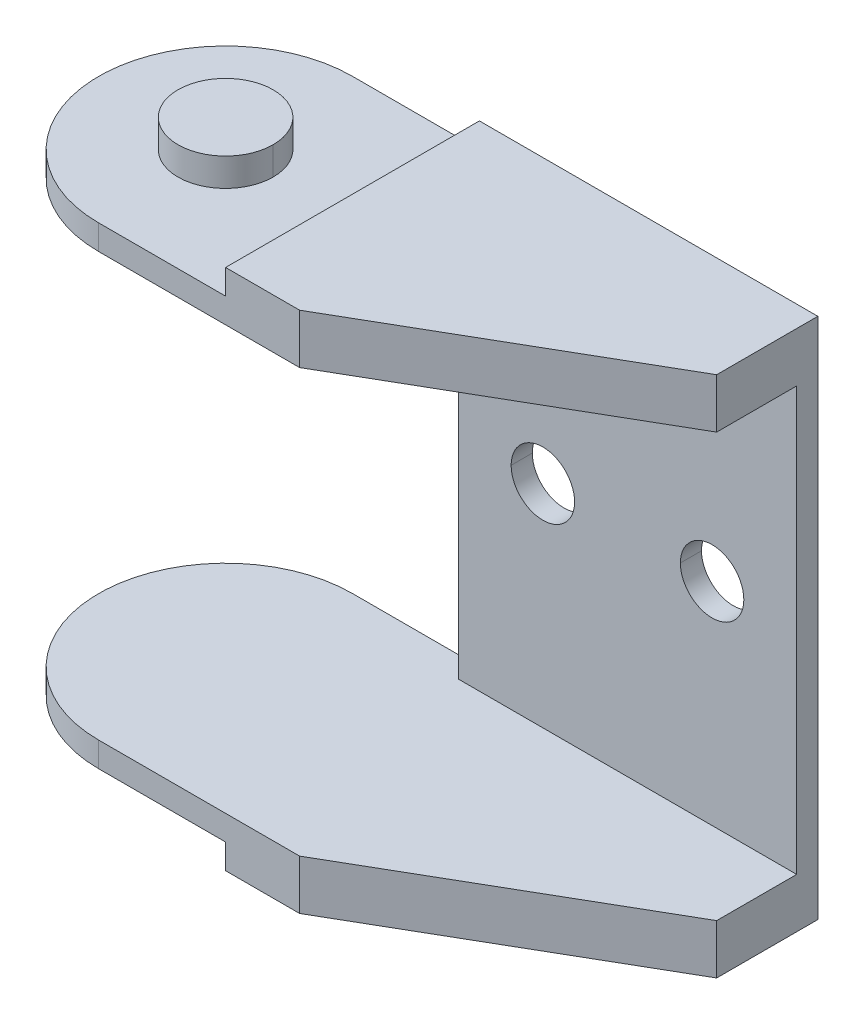
ISO-10303-21;
HEADER;
FILE_DESCRIPTION(('STEP AP214'),'2;1');
FILE_NAME('part.step','',(''),(''),'','','');
FILE_SCHEMA(('AUTOMOTIVE_DESIGN { 1 0 10303 214 1 1 1 1 }'));
ENDSEC;
DATA;
#1=APPLICATION_CONTEXT('core data for automotive mechanical design processes');
#2=APPLICATION_PROTOCOL_DEFINITION('international standard','automotive_design',2000,#1);
#3=PRODUCT_CONTEXT('',#1,'mechanical');
#4=PRODUCT('Part','Part','',(#3));
#5=PRODUCT_RELATED_PRODUCT_CATEGORY('part','',(#4));
#6=PRODUCT_DEFINITION_FORMATION('','',#4);
#7=PRODUCT_DEFINITION_CONTEXT('part definition',#1,'design');
#8=PRODUCT_DEFINITION('design','',#6,#7);
#9=PRODUCT_DEFINITION_SHAPE('','',#8);
#10=(LENGTH_UNIT() NAMED_UNIT(*) SI_UNIT(.MILLI.,.METRE.));
#11=(NAMED_UNIT(*) PLANE_ANGLE_UNIT() SI_UNIT($,.RADIAN.));
#12=(NAMED_UNIT(*) SI_UNIT($,.STERADIAN.) SOLID_ANGLE_UNIT());
#13=UNCERTAINTY_MEASURE_WITH_UNIT(LENGTH_MEASURE(1.E-05),#10,'distance_accuracy_value','');
#14=(GEOMETRIC_REPRESENTATION_CONTEXT(3) GLOBAL_UNCERTAINTY_ASSIGNED_CONTEXT((#13)) GLOBAL_UNIT_ASSIGNED_CONTEXT((#10,
#11,#12)) REPRESENTATION_CONTEXT('',''));
#15=CARTESIAN_POINT('',(0.,0.,0.));
#16=DIRECTION('',(0.,0.,1.));
#17=DIRECTION('',(1.,0.,0.));
#18=AXIS2_PLACEMENT_3D('',#15,#16,#17);
#19=CARTESIAN_POINT('',(22.,-2.35,-3.60843918245));
#20=DIRECTION('',(1.,0.,0.));
#21=DIRECTION('',(0.,1.,0.));
#22=AXIS2_PLACEMENT_3D('',#19,#20,#21);
#23=PLANE('',#22);
#24=DIRECTION('',(0.,1.,0.));
#25=VECTOR('',#24,1.);
#26=CARTESIAN_POINT('',(22.,-2.35,-6.));
#27=LINE('',#26,#25);
#28=CARTESIAN_POINT('',(22.,-2.35,-6.));
#29=VERTEX_POINT('',#28);
#30=CARTESIAN_POINT('',(22.,22.35,-6.));
#31=VERTEX_POINT('',#30);
#32=EDGE_CURVE('E340',#29,#31,#27,.T.);
#33=ORIENTED_EDGE('',*,*,#32,.T.);
#34=DIRECTION('',(0.,0.,1.));
#35=VECTOR('',#34,1.);
#36=CARTESIAN_POINT('',(22.,22.35,-1.2168783649));
#37=LINE('',#36,#35);
#38=CARTESIAN_POINT('',(22.,22.35,-1.2168783649));
#39=VERTEX_POINT('',#38);
#40=EDGE_CURVE('E365',#31,#39,#37,.T.);
#41=ORIENTED_EDGE('',*,*,#40,.T.);
#42=DIRECTION('',(0.,1.,0.));
#43=VECTOR('',#42,1.);
#44=CARTESIAN_POINT('',(22.,-2.35,-1.2168783649));
#45=LINE('',#44,#43);
#46=CARTESIAN_POINT('',(22.,20.,-1.2168783649));
#47=VERTEX_POINT('',#46);
#48=EDGE_CURVE('E288',#47,#39,#45,.T.);
#49=ORIENTED_EDGE('',*,*,#48,.F.);
#50=DIRECTION('',(0.,0.,-1.));
#51=VECTOR('',#50,1.);
#52=CARTESIAN_POINT('',(22.,20.,-1.804219591225));
#53=LINE('',#52,#51);
#54=CARTESIAN_POINT('',(22.,20.,-5.));
#55=VERTEX_POINT('',#54);
#56=EDGE_CURVE('E350',#47,#55,#53,.T.);
#57=ORIENTED_EDGE('',*,*,#56,.T.);
#58=DIRECTION('',(0.,1.,0.));
#59=VECTOR('',#58,1.);
#60=CARTESIAN_POINT('',(22.,-1.175,-5.));
#61=LINE('',#60,#59);
#62=CARTESIAN_POINT('',(22.,0.,-5.));
#63=VERTEX_POINT('',#62);
#64=EDGE_CURVE('E274',#63,#55,#61,.T.);
#65=ORIENTED_EDGE('',*,*,#64,.F.);
#66=DIRECTION('',(0.,0.,1.));
#67=VECTOR('',#66,1.);
#68=CARTESIAN_POINT('',(22.,0.,-1.804219591225));
#69=LINE('',#68,#67);
#70=CARTESIAN_POINT('',(22.,0.,-1.2168783649));
#71=VERTEX_POINT('',#70);
#72=EDGE_CURVE('E11',#63,#71,#69,.T.);
#73=ORIENTED_EDGE('',*,*,#72,.T.);
#74=DIRECTION('',(0.,1.,0.));
#75=VECTOR('',#74,1.);
#76=CARTESIAN_POINT('',(22.,-2.35,-1.2168783649));
#77=LINE('',#76,#75);
#78=CARTESIAN_POINT('',(22.,-2.35,-1.2168783649));
#79=VERTEX_POINT('',#78);
#80=EDGE_CURVE('E348',#79,#71,#77,.T.);
#81=ORIENTED_EDGE('',*,*,#80,.F.);
#82=DIRECTION('',(0.,0.,-1.));
#83=VECTOR('',#82,1.);
#84=CARTESIAN_POINT('',(22.,-2.35,-1.2168783649));
#85=LINE('',#84,#83);
#86=EDGE_CURVE('E282',#79,#29,#85,.T.);
#87=ORIENTED_EDGE('',*,*,#86,.T.);
#88=EDGE_LOOP('',(#33,#41,#49,#57,#65,#73,#81,#87));
#89=FACE_BOUND('',#88,.T.);
#90=ADVANCED_FACE('F16',(#89),#23,.T.);
#91=CARTESIAN_POINT('',(0.,-2.35,0.));
#92=DIRECTION('',(0.,1.,0.));
#93=DIRECTION('',(0.,0.,1.));
#94=AXIS2_PLACEMENT_3D('',#91,#92,#93);
#95=CYLINDRICAL_SURFACE('',#94,6.);
#96=CARTESIAN_POINT('',(0.,-1.175,0.));
#97=DIRECTION('',(0.,1.,0.));
#98=DIRECTION('',(0.,0.,1.));
#99=AXIS2_PLACEMENT_3D('',#96,#97,#98);
#100=CIRCLE('',#99,6.);
#101=CARTESIAN_POINT('',(0.,-1.175,-6.));
#102=VERTEX_POINT('',#101);
#103=CARTESIAN_POINT('',(0.,-1.175,6.));
#104=VERTEX_POINT('',#103);
#105=EDGE_CURVE('E293',#102,#104,#100,.T.);
#106=ORIENTED_EDGE('',*,*,#105,.T.);
#107=DIRECTION('',(0.,1.,0.));
#108=VECTOR('',#107,1.);
#109=CARTESIAN_POINT('',(0.,-2.35,6.));
#110=LINE('',#109,#108);
#111=CARTESIAN_POINT('',(0.,0.,6.));
#112=VERTEX_POINT('',#111);
#113=EDGE_CURVE('E393',#104,#112,#110,.T.);
#114=ORIENTED_EDGE('',*,*,#113,.T.);
#115=CARTESIAN_POINT('',(0.,0.,0.));
#116=DIRECTION('',(0.,-1.,0.));
#117=DIRECTION('',(0.,0.,1.));
#118=AXIS2_PLACEMENT_3D('',#115,#116,#117);
#119=CIRCLE('',#118,6.);
#120=CARTESIAN_POINT('',(0.,0.,-6.));
#121=VERTEX_POINT('',#120);
#122=EDGE_CURVE('E25',#112,#121,#119,.T.);
#123=ORIENTED_EDGE('',*,*,#122,.T.);
#124=DIRECTION('',(0.,1.,0.));
#125=VECTOR('',#124,1.);
#126=CARTESIAN_POINT('',(0.,-2.35,-6.));
#127=LINE('',#126,#125);
#128=EDGE_CURVE('E341',#102,#121,#127,.T.);
#129=ORIENTED_EDGE('',*,*,#128,.F.);
#130=EDGE_LOOP('',(#106,#114,#123,#129));
#131=FACE_BOUND('',#130,.T.);
#132=ADVANCED_FACE('F544',(#131),#95,.T.);
#133=CARTESIAN_POINT('',(0.,0.,0.));
#134=DIRECTION('',(0.,-1.,0.));
#135=DIRECTION('',(0.,0.,-1.));
#136=AXIS2_PLACEMENT_3D('',#133,#134,#135);
#137=PLANE('',#136);
#138=DIRECTION('',(0.,0.,-1.));
#139=VECTOR('',#138,1.);
#140=CARTESIAN_POINT('',(6.,0.,-2.75));
#141=LINE('',#140,#139);
#142=CARTESIAN_POINT('',(6.,0.,-5.));
#143=VERTEX_POINT('',#142);
#144=CARTESIAN_POINT('',(6.,0.,-6.));
#145=VERTEX_POINT('',#144);
#146=EDGE_CURVE('E399',#143,#145,#141,.T.);
#147=ORIENTED_EDGE('',*,*,#146,.T.);
#148=DIRECTION('',(1.,0.,0.));
#149=VECTOR('',#148,1.);
#150=CARTESIAN_POINT('',(5.5,0.,-6.));
#151=LINE('',#150,#149);
#152=EDGE_CURVE('E337',#121,#145,#151,.T.);
#153=ORIENTED_EDGE('',*,*,#152,.F.);
#154=ORIENTED_EDGE('',*,*,#122,.F.);
#155=DIRECTION('',(-1.,0.,0.));
#156=VECTOR('',#155,1.);
#157=CARTESIAN_POINT('',(2.375,0.,6.));
#158=LINE('',#157,#156);
#159=CARTESIAN_POINT('',(9.5,0.,6.));
#160=VERTEX_POINT('',#159);
#161=EDGE_CURVE('E47',#160,#112,#158,.T.);
#162=ORIENTED_EDGE('',*,*,#161,.F.);
#163=DIRECTION('',(-0.866025403783548,0.,0.500000000001542));
#164=VECTOR('',#163,1.);
#165=CARTESIAN_POINT('',(14.4865381056782,0.,3.12102088235054));
#166=LINE('',#165,#164);
#167=EDGE_CURVE('E349',#71,#160,#166,.T.);
#168=ORIENTED_EDGE('',*,*,#167,.F.);
#169=ORIENTED_EDGE('',*,*,#72,.F.);
#170=DIRECTION('',(-1.,0.,0.));
#171=VECTOR('',#170,1.);
#172=CARTESIAN_POINT('',(7.,0.,-5.));
#173=LINE('',#172,#171);
#174=EDGE_CURVE('E332',#63,#143,#173,.T.);
#175=ORIENTED_EDGE('',*,*,#174,.T.);
#176=EDGE_LOOP('',(#147,#153,#154,#162,#168,#169,#175));
#177=FACE_BOUND('',#176,.T.);
#178=ADVANCED_FACE('F540',(#177),#137,.F.);
#179=CARTESIAN_POINT('',(4.75,-2.35,6.));
#180=DIRECTION('',(0.,0.,1.));
#181=DIRECTION('',(1.,0.,0.));
#182=AXIS2_PLACEMENT_3D('',#179,#180,#181);
#183=PLANE('',#182);
#184=DIRECTION('',(0.,-1.,0.));
#185=VECTOR('',#184,1.);
#186=CARTESIAN_POINT('',(6.,-2.05625,6.));
#187=LINE('',#186,#185);
#188=CARTESIAN_POINT('',(6.,-1.175,6.));
#189=VERTEX_POINT('',#188);
#190=CARTESIAN_POINT('',(6.,-2.35,6.));
#191=VERTEX_POINT('',#190);
#192=EDGE_CURVE('E207',#189,#191,#187,.T.);
#193=ORIENTED_EDGE('',*,*,#192,.T.);
#194=DIRECTION('',(1.,0.,0.));
#195=VECTOR('',#194,1.);
#196=CARTESIAN_POINT('',(0.,-2.35,6.));
#197=LINE('',#196,#195);
#198=CARTESIAN_POINT('',(9.5,-2.35,6.));
#199=VERTEX_POINT('',#198);
#200=EDGE_CURVE('E219',#191,#199,#197,.T.);
#201=ORIENTED_EDGE('',*,*,#200,.T.);
#202=DIRECTION('',(0.,1.,0.));
#203=VECTOR('',#202,1.);
#204=CARTESIAN_POINT('',(9.5,-2.35,6.));
#205=LINE('',#204,#203);
#206=EDGE_CURVE('E346',#199,#160,#205,.T.);
#207=ORIENTED_EDGE('',*,*,#206,.T.);
#208=ORIENTED_EDGE('',*,*,#161,.T.);
#209=ORIENTED_EDGE('',*,*,#113,.F.);
#210=DIRECTION('',(1.,0.,0.));
#211=VECTOR('',#210,1.);
#212=CARTESIAN_POINT('',(-2.125,-1.175,6.));
#213=LINE('',#212,#211);
#214=EDGE_CURVE('E277',#104,#189,#213,.T.);
#215=ORIENTED_EDGE('',*,*,#214,.T.);
#216=EDGE_LOOP('',(#193,#201,#207,#208,#209,#215));
#217=FACE_BOUND('',#216,.T.);
#218=ADVANCED_FACE('F543',(#217),#183,.T.);
#219=CARTESIAN_POINT('',(15.75,-2.35,2.39156081755));
#220=DIRECTION('',(0.500000000001542,0.,0.866025403783548));
#221=DIRECTION('',(0.,-1.,0.));
#222=AXIS2_PLACEMENT_3D('',#219,#220,#221);
#223=PLANE('',#222);
#224=ORIENTED_EDGE('',*,*,#167,.T.);
#225=ORIENTED_EDGE('',*,*,#206,.F.);
#226=DIRECTION('',(0.866025403783548,0.,-0.500000000001542));
#227=VECTOR('',#226,1.);
#228=CARTESIAN_POINT('',(9.5,-2.35,6.));
#229=LINE('',#228,#227);
#230=EDGE_CURVE('E286',#199,#79,#229,.T.);
#231=ORIENTED_EDGE('',*,*,#230,.T.);
#232=ORIENTED_EDGE('',*,*,#80,.T.);
#233=EDGE_LOOP('',(#224,#225,#231,#232));
#234=FACE_BOUND('',#233,.T.);
#235=ADVANCED_FACE('F538',(#234),#223,.T.);
#236=CARTESIAN_POINT('',(11.,-2.35,-6.));
#237=DIRECTION('',(0.,0.,-1.));
#238=DIRECTION('',(0.,-1.,0.));
#239=AXIS2_PLACEMENT_3D('',#236,#237,#238);
#240=PLANE('',#239);
#241=CARTESIAN_POINT('',(18.,10.,-6.));
#242=DIRECTION('',(0.,0.,1.));
#243=DIRECTION('',(1.,0.,0.));
#244=AXIS2_PLACEMENT_3D('',#241,#242,#243);
#245=CIRCLE('',#244,1.5);
#246=CARTESIAN_POINT('',(19.5,10.,-6.));
#247=VERTEX_POINT('',#246);
#248=CARTESIAN_POINT('',(16.5,10.,-6.));
#249=VERTEX_POINT('',#248);
#250=EDGE_CURVE('E322',#247,#249,#245,.T.);
#251=ORIENTED_EDGE('',*,*,#250,.T.);
#252=CARTESIAN_POINT('',(18.,10.,-6.));
#253=DIRECTION('',(0.,0.,1.));
#254=DIRECTION('',(1.,0.,0.));
#255=AXIS2_PLACEMENT_3D('',#252,#253,#254);
#256=CIRCLE('',#255,1.5);
#257=EDGE_CURVE('E307',#249,#247,#256,.T.);
#258=ORIENTED_EDGE('',*,*,#257,.T.);
#259=EDGE_LOOP('',(#251,#258));
#260=FACE_BOUND('',#259,.T.);
#261=CARTESIAN_POINT('',(10.,10.,-6.));
#262=DIRECTION('',(0.,0.,1.));
#263=DIRECTION('',(1.,0.,0.));
#264=AXIS2_PLACEMENT_3D('',#261,#262,#263);
#265=CIRCLE('',#264,1.5);
#266=CARTESIAN_POINT('',(11.5,10.,-6.));
#267=VERTEX_POINT('',#266);
#268=CARTESIAN_POINT('',(8.5,10.,-6.));
#269=VERTEX_POINT('',#268);
#270=EDGE_CURVE('E313',#267,#269,#265,.T.);
#271=ORIENTED_EDGE('',*,*,#270,.T.);
#272=CARTESIAN_POINT('',(10.,10.,-6.));
#273=DIRECTION('',(0.,0.,1.));
#274=DIRECTION('',(1.,0.,0.));
#275=AXIS2_PLACEMENT_3D('',#272,#273,#274);
#276=CIRCLE('',#275,1.5);
#277=EDGE_CURVE('E308',#269,#267,#276,.T.);
#278=ORIENTED_EDGE('',*,*,#277,.T.);
#279=EDGE_LOOP('',(#271,#278));
#280=FACE_BOUND('',#279,.T.);
#281=DIRECTION('',(0.,1.,0.));
#282=VECTOR('',#281,1.);
#283=CARTESIAN_POINT('',(6.,-2.05625,-6.));
#284=LINE('',#283,#282);
#285=CARTESIAN_POINT('',(6.,-2.35,-6.));
#286=VERTEX_POINT('',#285);
#287=CARTESIAN_POINT('',(6.,-1.175,-6.));
#288=VERTEX_POINT('',#287);
#289=EDGE_CURVE('E385',#286,#288,#284,.T.);
#290=ORIENTED_EDGE('',*,*,#289,.T.);
#291=DIRECTION('',(-1.,0.,0.));
#292=VECTOR('',#291,1.);
#293=CARTESIAN_POINT('',(1.,-1.175,-6.));
#294=LINE('',#293,#292);
#295=EDGE_CURVE('E296',#288,#102,#294,.T.);
#296=ORIENTED_EDGE('',*,*,#295,.T.);
#297=ORIENTED_EDGE('',*,*,#128,.T.);
#298=ORIENTED_EDGE('',*,*,#152,.T.);
#299=DIRECTION('',(0.,1.,0.));
#300=VECTOR('',#299,1.);
#301=CARTESIAN_POINT('',(6.,-1.175,-6.));
#302=LINE('',#301,#300);
#303=CARTESIAN_POINT('',(6.,20.,-6.));
#304=VERTEX_POINT('',#303);
#305=EDGE_CURVE('E273',#145,#304,#302,.T.);
#306=ORIENTED_EDGE('',*,*,#305,.T.);
#307=DIRECTION('',(-1.,0.,0.));
#308=VECTOR('',#307,1.);
#309=CARTESIAN_POINT('',(5.5,20.,-6.));
#310=LINE('',#309,#308);
#311=CARTESIAN_POINT('',(0.,20.,-6.));
#312=VERTEX_POINT('',#311);
#313=EDGE_CURVE('E465',#304,#312,#310,.T.);
#314=ORIENTED_EDGE('',*,*,#313,.T.);
#315=DIRECTION('',(0.,1.,0.));
#316=VECTOR('',#315,1.);
#317=CARTESIAN_POINT('',(0.,-2.35,-6.));
#318=LINE('',#317,#316);
#319=CARTESIAN_POINT('',(0.,21.175,-6.));
#320=VERTEX_POINT('',#319);
#321=EDGE_CURVE('E345',#312,#320,#318,.T.);
#322=ORIENTED_EDGE('',*,*,#321,.T.);
#323=DIRECTION('',(1.,0.,0.));
#324=VECTOR('',#323,1.);
#325=CARTESIAN_POINT('',(1.,21.175,-6.));
#326=LINE('',#325,#324);
#327=CARTESIAN_POINT('',(6.,21.175,-6.));
#328=VERTEX_POINT('',#327);
#329=EDGE_CURVE('E247',#320,#328,#326,.T.);
#330=ORIENTED_EDGE('',*,*,#329,.T.);
#331=DIRECTION('',(0.,1.,0.));
#332=VECTOR('',#331,1.);
#333=CARTESIAN_POINT('',(6.,9.70625,-6.));
#334=LINE('',#333,#332);
#335=CARTESIAN_POINT('',(6.,22.35,-6.));
#336=VERTEX_POINT('',#335);
#337=EDGE_CURVE('E253',#328,#336,#334,.T.);
#338=ORIENTED_EDGE('',*,*,#337,.T.);
#339=DIRECTION('',(1.,0.,0.));
#340=VECTOR('',#339,1.);
#341=CARTESIAN_POINT('',(22.,22.35,-6.));
#342=LINE('',#341,#340);
#343=EDGE_CURVE('E353',#336,#31,#342,.T.);
#344=ORIENTED_EDGE('',*,*,#343,.T.);
#345=ORIENTED_EDGE('',*,*,#32,.F.);
#346=DIRECTION('',(-1.,0.,0.));
#347=VECTOR('',#346,1.);
#348=CARTESIAN_POINT('',(22.,-2.35,-6.));
#349=LINE('',#348,#347);
#350=EDGE_CURVE('E287',#29,#286,#349,.T.);
#351=ORIENTED_EDGE('',*,*,#350,.T.);
#352=EDGE_LOOP('',(#290,#296,#297,#298,#306,#314,#322,#330,#338,#344,#345,#351));
#353=FACE_BOUND('',#352,.T.);
#354=ADVANCED_FACE('F593',(#260,#280,#353),#240,.T.);
#355=CARTESIAN_POINT('',(7.97467966244913,-2.35,-0.830003680221399));
#356=DIRECTION('',(0.,-1.,0.));
#357=DIRECTION('',(0.,0.,-1.));
#358=AXIS2_PLACEMENT_3D('',#355,#356,#357);
#359=PLANE('',#358);
#360=DIRECTION('',(0.,0.,-1.));
#361=VECTOR('',#360,1.);
#362=CARTESIAN_POINT('',(6.,-2.35,-0.415001840110699));
#363=LINE('',#362,#361);
#364=EDGE_CURVE('E280',#191,#286,#363,.T.);
#365=ORIENTED_EDGE('',*,*,#364,.T.);
#366=ORIENTED_EDGE('',*,*,#350,.F.);
#367=ORIENTED_EDGE('',*,*,#86,.F.);
#368=ORIENTED_EDGE('',*,*,#230,.F.);
#369=ORIENTED_EDGE('',*,*,#200,.F.);
#370=EDGE_LOOP('',(#365,#366,#367,#368,#369));
#371=FACE_BOUND('',#370,.T.);
#372=ADVANCED_FACE('F603',(#371),#359,.T.);
#373=CARTESIAN_POINT('',(6.,-1.7625,0.));
#374=DIRECTION('',(-1.,0.,0.));
#375=DIRECTION('',(0.,0.,1.));
#376=AXIS2_PLACEMENT_3D('',#373,#374,#375);
#377=PLANE('',#376);
#378=ORIENTED_EDGE('',*,*,#364,.F.);
#379=ORIENTED_EDGE('',*,*,#192,.F.);
#380=DIRECTION('',(0.,0.,-1.));
#381=VECTOR('',#380,1.);
#382=CARTESIAN_POINT('',(6.,-1.175,0.));
#383=LINE('',#382,#381);
#384=EDGE_CURVE('E281',#189,#288,#383,.T.);
#385=ORIENTED_EDGE('',*,*,#384,.T.);
#386=ORIENTED_EDGE('',*,*,#289,.F.);
#387=EDGE_LOOP('',(#378,#379,#385,#386));
#388=FACE_BOUND('',#387,.T.);
#389=ADVANCED_FACE('F614',(#388),#377,.T.);
#390=CARTESIAN_POINT('',(-9.,-1.175,0.));
#391=DIRECTION('',(0.,-1.,0.));
#392=DIRECTION('',(0.,0.,-1.));
#393=AXIS2_PLACEMENT_3D('',#390,#391,#392);
#394=PLANE('',#393);
#395=CARTESIAN_POINT('',(0.,-1.175,0.));
#396=DIRECTION('',(0.,1.,0.));
#397=DIRECTION('',(1.,0.,0.));
#398=AXIS2_PLACEMENT_3D('',#395,#396,#397);
#399=CIRCLE('',#398,2.25);
#400=CARTESIAN_POINT('',(2.25,-1.175,0.));
#401=VERTEX_POINT('',#400);
#402=CARTESIAN_POINT('',(-2.25,-1.175,0.));
#403=VERTEX_POINT('',#402);
#404=EDGE_CURVE('E297',#401,#403,#399,.T.);
#405=ORIENTED_EDGE('',*,*,#404,.T.);
#406=CARTESIAN_POINT('',(0.,-1.175,0.));
#407=DIRECTION('',(0.,1.,0.));
#408=DIRECTION('',(1.,0.,0.));
#409=AXIS2_PLACEMENT_3D('',#406,#407,#408);
#410=CIRCLE('',#409,2.25);
#411=EDGE_CURVE('E303',#403,#401,#410,.T.);
#412=ORIENTED_EDGE('',*,*,#411,.T.);
#413=EDGE_LOOP('',(#405,#412));
#414=FACE_BOUND('',#413,.T.);
#415=ORIENTED_EDGE('',*,*,#105,.F.);
#416=ORIENTED_EDGE('',*,*,#295,.F.);
#417=ORIENTED_EDGE('',*,*,#384,.F.);
#418=ORIENTED_EDGE('',*,*,#214,.F.);
#419=EDGE_LOOP('',(#415,#416,#417,#418));
#420=FACE_BOUND('',#419,.T.);
#421=ADVANCED_FACE('F624',(#414,#420),#394,.T.);
#422=CARTESIAN_POINT('',(0.,-2.5,0.));
#423=DIRECTION('',(0.,-1.,0.));
#424=DIRECTION('',(0.,0.,-1.));
#425=AXIS2_PLACEMENT_3D('',#422,#423,#424);
#426=PLANE('',#425);
#427=CARTESIAN_POINT('',(0.,-2.5,0.));
#428=DIRECTION('',(0.,-1.,0.));
#429=DIRECTION('',(1.,0.,0.));
#430=AXIS2_PLACEMENT_3D('',#427,#428,#429);
#431=CIRCLE('',#430,2.25);
#432=CARTESIAN_POINT('',(2.25,-2.5,0.));
#433=VERTEX_POINT('',#432);
#434=CARTESIAN_POINT('',(-2.25,-2.5,0.));
#435=VERTEX_POINT('',#434);
#436=EDGE_CURVE('E441',#433,#435,#431,.T.);
#437=ORIENTED_EDGE('',*,*,#436,.T.);
#438=CARTESIAN_POINT('',(0.,-2.5,0.));
#439=DIRECTION('',(0.,-1.,0.));
#440=DIRECTION('',(1.,0.,0.));
#441=AXIS2_PLACEMENT_3D('',#438,#439,#440);
#442=CIRCLE('',#441,2.25);
#443=EDGE_CURVE('E291',#435,#433,#442,.T.);
#444=ORIENTED_EDGE('',*,*,#443,.T.);
#445=EDGE_LOOP('',(#437,#444));
#446=FACE_BOUND('',#445,.T.);
#447=ADVANCED_FACE('F507',(#446),#426,.T.);
#448=CARTESIAN_POINT('',(0.,-1.8375,0.));
#449=DIRECTION('',(0.,-1.,0.));
#450=DIRECTION('',(1.,0.,0.));
#451=AXIS2_PLACEMENT_3D('',#448,#449,#450);
#452=CYLINDRICAL_SURFACE('',#451,2.25);
#453=DIRECTION('',(0.,-1.,0.));
#454=VECTOR('',#453,1.);
#455=CARTESIAN_POINT('',(2.25,-1.8375,0.));
#456=LINE('',#455,#454);
#457=EDGE_CURVE('E299',#401,#433,#456,.T.);
#458=ORIENTED_EDGE('',*,*,#457,.T.);
#459=ORIENTED_EDGE('',*,*,#443,.F.);
#460=DIRECTION('',(0.,1.,0.));
#461=VECTOR('',#460,1.);
#462=CARTESIAN_POINT('',(-2.25,-1.8375,0.));
#463=LINE('',#462,#461);
#464=EDGE_CURVE('E422',#435,#403,#463,.T.);
#465=ORIENTED_EDGE('',*,*,#464,.T.);
#466=ORIENTED_EDGE('',*,*,#404,.F.);
#467=EDGE_LOOP('',(#458,#459,#465,#466));
#468=FACE_BOUND('',#467,.T.);
#469=ADVANCED_FACE('F513',(#468),#452,.T.);
#470=CARTESIAN_POINT('',(15.75,-2.35,2.39156081755));
#471=DIRECTION('',(0.500000000001542,0.,0.866025403783548));
#472=DIRECTION('',(0.,-1.,0.));
#473=AXIS2_PLACEMENT_3D('',#470,#471,#472);
#474=PLANE('',#473);
#475=DIRECTION('',(0.866025403783548,0.,-0.500000000001542));
#476=VECTOR('',#475,1.);
#477=CARTESIAN_POINT('',(14.4865381056782,20.,3.12102088235054));
#478=LINE('',#477,#476);
#479=CARTESIAN_POINT('',(9.5,20.,6.));
#480=VERTEX_POINT('',#479);
#481=EDGE_CURVE('E352',#480,#47,#478,.T.);
#482=ORIENTED_EDGE('',*,*,#481,.T.);
#483=ORIENTED_EDGE('',*,*,#48,.T.);
#484=DIRECTION('',(-0.866025403783548,0.,0.500000000001542));
#485=VECTOR('',#484,1.);
#486=CARTESIAN_POINT('',(9.5,22.35,6.));
#487=LINE('',#486,#485);
#488=CARTESIAN_POINT('',(9.5,22.35,6.));
#489=VERTEX_POINT('',#488);
#490=EDGE_CURVE('E374',#39,#489,#487,.T.);
#491=ORIENTED_EDGE('',*,*,#490,.T.);
#492=DIRECTION('',(0.,1.,0.));
#493=VECTOR('',#492,1.);
#494=CARTESIAN_POINT('',(9.5,-2.35,6.));
#495=LINE('',#494,#493);
#496=EDGE_CURVE('E292',#480,#489,#495,.T.);
#497=ORIENTED_EDGE('',*,*,#496,.F.);
#498=EDGE_LOOP('',(#482,#483,#491,#497));
#499=FACE_BOUND('',#498,.T.);
#500=ADVANCED_FACE('F525',(#499),#474,.T.);
#501=CARTESIAN_POINT('',(4.75,-2.35,6.));
#502=DIRECTION('',(0.,0.,1.));
#503=DIRECTION('',(1.,0.,0.));
#504=AXIS2_PLACEMENT_3D('',#501,#502,#503);
#505=PLANE('',#504);
#506=DIRECTION('',(-1.,0.,0.));
#507=VECTOR('',#506,1.);
#508=CARTESIAN_POINT('',(-2.125,21.175,6.));
#509=LINE('',#508,#507);
#510=CARTESIAN_POINT('',(6.,21.175,6.));
#511=VERTEX_POINT('',#510);
#512=CARTESIAN_POINT('',(0.,21.175,6.));
#513=VERTEX_POINT('',#512);
#514=EDGE_CURVE('E238',#511,#513,#509,.T.);
#515=ORIENTED_EDGE('',*,*,#514,.T.);
#516=DIRECTION('',(0.,1.,0.));
#517=VECTOR('',#516,1.);
#518=CARTESIAN_POINT('',(0.,-2.35,6.));
#519=LINE('',#518,#517);
#520=CARTESIAN_POINT('',(0.,20.,6.));
#521=VERTEX_POINT('',#520);
#522=EDGE_CURVE('E333',#521,#513,#519,.T.);
#523=ORIENTED_EDGE('',*,*,#522,.F.);
#524=DIRECTION('',(1.,0.,0.));
#525=VECTOR('',#524,1.);
#526=CARTESIAN_POINT('',(2.375,20.,6.));
#527=LINE('',#526,#525);
#528=EDGE_CURVE('E361',#521,#480,#527,.T.);
#529=ORIENTED_EDGE('',*,*,#528,.T.);
#530=ORIENTED_EDGE('',*,*,#496,.T.);
#531=DIRECTION('',(-1.,0.,0.));
#532=VECTOR('',#531,1.);
#533=CARTESIAN_POINT('',(0.,22.35,6.));
#534=LINE('',#533,#532);
#535=CARTESIAN_POINT('',(6.,22.35,6.));
#536=VERTEX_POINT('',#535);
#537=EDGE_CURVE('E241',#489,#536,#534,.T.);
#538=ORIENTED_EDGE('',*,*,#537,.T.);
#539=DIRECTION('',(0.,-1.,0.));
#540=VECTOR('',#539,1.);
#541=CARTESIAN_POINT('',(6.,9.70625,6.));
#542=LINE('',#541,#540);
#543=EDGE_CURVE('E233',#536,#511,#542,.T.);
#544=ORIENTED_EDGE('',*,*,#543,.T.);
#545=EDGE_LOOP('',(#515,#523,#529,#530,#538,#544));
#546=FACE_BOUND('',#545,.T.);
#547=ADVANCED_FACE('F235',(#546),#505,.T.);
#548=CARTESIAN_POINT('',(0.,20.,0.));
#549=DIRECTION('',(0.,-1.,0.));
#550=DIRECTION('',(0.,0.,-1.));
#551=AXIS2_PLACEMENT_3D('',#548,#549,#550);
#552=PLANE('',#551);
#553=DIRECTION('',(1.,0.,0.));
#554=VECTOR('',#553,1.);
#555=CARTESIAN_POINT('',(7.,20.,-5.));
#556=LINE('',#555,#554);
#557=CARTESIAN_POINT('',(6.,20.,-5.));
#558=VERTEX_POINT('',#557);
#559=EDGE_CURVE('E414',#558,#55,#556,.T.);
#560=ORIENTED_EDGE('',*,*,#559,.T.);
#561=ORIENTED_EDGE('',*,*,#56,.F.);
#562=ORIENTED_EDGE('',*,*,#481,.F.);
#563=ORIENTED_EDGE('',*,*,#528,.F.);
#564=CARTESIAN_POINT('',(0.,20.,0.));
#565=DIRECTION('',(0.,1.,0.));
#566=DIRECTION('',(0.,0.,1.));
#567=AXIS2_PLACEMENT_3D('',#564,#565,#566);
#568=CIRCLE('',#567,6.);
#569=EDGE_CURVE('E336',#312,#521,#568,.T.);
#570=ORIENTED_EDGE('',*,*,#569,.F.);
#571=ORIENTED_EDGE('',*,*,#313,.F.);
#572=DIRECTION('',(0.,0.,1.));
#573=VECTOR('',#572,1.);
#574=CARTESIAN_POINT('',(6.,20.,-2.75));
#575=LINE('',#574,#573);
#576=EDGE_CURVE('E271',#304,#558,#575,.T.);
#577=ORIENTED_EDGE('',*,*,#576,.T.);
#578=EDGE_LOOP('',(#560,#561,#562,#563,#570,#571,#577));
#579=FACE_BOUND('',#578,.T.);
#580=ADVANCED_FACE('F530',(#579),#552,.T.);
#581=CARTESIAN_POINT('',(7.97467966244913,22.35,-0.830003680221399));
#582=DIRECTION('',(0.,-1.,0.));
#583=DIRECTION('',(0.,0.,-1.));
#584=AXIS2_PLACEMENT_3D('',#581,#582,#583);
#585=PLANE('',#584);
#586=DIRECTION('',(0.,0.,1.));
#587=VECTOR('',#586,1.);
#588=CARTESIAN_POINT('',(6.,22.35,-0.4150018401107));
#589=LINE('',#588,#587);
#590=EDGE_CURVE('E246',#336,#536,#589,.T.);
#591=ORIENTED_EDGE('',*,*,#590,.T.);
#592=ORIENTED_EDGE('',*,*,#537,.F.);
#593=ORIENTED_EDGE('',*,*,#490,.F.);
#594=ORIENTED_EDGE('',*,*,#40,.F.);
#595=ORIENTED_EDGE('',*,*,#343,.F.);
#596=EDGE_LOOP('',(#591,#592,#593,#594,#595));
#597=FACE_BOUND('',#596,.T.);
#598=ADVANCED_FACE('F680',(#597),#585,.F.);
#599=CARTESIAN_POINT('',(0.,-2.35,0.));
#600=DIRECTION('',(0.,1.,0.));
#601=DIRECTION('',(0.,0.,1.));
#602=AXIS2_PLACEMENT_3D('',#599,#600,#601);
#603=CYLINDRICAL_SURFACE('',#602,6.);
#604=CARTESIAN_POINT('',(0.,21.175,0.));
#605=DIRECTION('',(0.,-1.,0.));
#606=DIRECTION('',(0.,0.,1.));
#607=AXIS2_PLACEMENT_3D('',#604,#605,#606);
#608=CIRCLE('',#607,6.);
#609=EDGE_CURVE('E261',#513,#320,#608,.T.);
#610=ORIENTED_EDGE('',*,*,#609,.T.);
#611=ORIENTED_EDGE('',*,*,#321,.F.);
#612=ORIENTED_EDGE('',*,*,#569,.T.);
#613=ORIENTED_EDGE('',*,*,#522,.T.);
#614=EDGE_LOOP('',(#610,#611,#612,#613));
#615=FACE_BOUND('',#614,.T.);
#616=ADVANCED_FACE('F690',(#615),#603,.T.);
#617=CARTESIAN_POINT('',(6.,21.7625,0.));
#618=DIRECTION('',(-1.,0.,0.));
#619=DIRECTION('',(0.,0.,1.));
#620=AXIS2_PLACEMENT_3D('',#617,#618,#619);
#621=PLANE('',#620);
#622=DIRECTION('',(0.,0.,-1.));
#623=VECTOR('',#622,1.);
#624=CARTESIAN_POINT('',(6.,21.175,0.));
#625=LINE('',#624,#623);
#626=EDGE_CURVE('E250',#511,#328,#625,.T.);
#627=ORIENTED_EDGE('',*,*,#626,.F.);
#628=ORIENTED_EDGE('',*,*,#543,.F.);
#629=ORIENTED_EDGE('',*,*,#590,.F.);
#630=ORIENTED_EDGE('',*,*,#337,.F.);
#631=EDGE_LOOP('',(#627,#628,#629,#630));
#632=FACE_BOUND('',#631,.T.);
#633=ADVANCED_FACE('F251',(#632),#621,.T.);
#634=CARTESIAN_POINT('',(-9.,21.175,0.));
#635=DIRECTION('',(0.,1.,0.));
#636=DIRECTION('',(1.,0.,0.));
#637=AXIS2_PLACEMENT_3D('',#634,#635,#636);
#638=PLANE('',#637);
#639=CARTESIAN_POINT('',(0.,21.175,0.));
#640=DIRECTION('',(0.,-1.,0.));
#641=DIRECTION('',(1.,0.,0.));
#642=AXIS2_PLACEMENT_3D('',#639,#640,#641);
#643=CIRCLE('',#642,2.25);
#644=CARTESIAN_POINT('',(2.25,21.175,0.));
#645=VERTEX_POINT('',#644);
#646=CARTESIAN_POINT('',(-2.25,21.175,0.));
#647=VERTEX_POINT('',#646);
#648=EDGE_CURVE('E327',#645,#647,#643,.T.);
#649=ORIENTED_EDGE('',*,*,#648,.T.);
#650=CARTESIAN_POINT('',(0.,21.175,0.));
#651=DIRECTION('',(0.,-1.,0.));
#652=DIRECTION('',(1.,0.,0.));
#653=AXIS2_PLACEMENT_3D('',#650,#651,#652);
#654=CIRCLE('',#653,2.25);
#655=EDGE_CURVE('E435',#647,#645,#654,.T.);
#656=ORIENTED_EDGE('',*,*,#655,.T.);
#657=EDGE_LOOP('',(#649,#656));
#658=FACE_BOUND('',#657,.T.);
#659=ORIENTED_EDGE('',*,*,#609,.F.);
#660=ORIENTED_EDGE('',*,*,#514,.F.);
#661=ORIENTED_EDGE('',*,*,#626,.T.);
#662=ORIENTED_EDGE('',*,*,#329,.F.);
#663=EDGE_LOOP('',(#659,#660,#661,#662));
#664=FACE_BOUND('',#663,.T.);
#665=ADVANCED_FACE('F259',(#658,#664),#638,.T.);
#666=CARTESIAN_POINT('',(0.,22.5,0.));
#667=DIRECTION('',(0.,1.,0.));
#668=DIRECTION('',(1.,0.,0.));
#669=AXIS2_PLACEMENT_3D('',#666,#667,#668);
#670=PLANE('',#669);
#671=CARTESIAN_POINT('',(0.,22.5,0.));
#672=DIRECTION('',(0.,1.,0.));
#673=DIRECTION('',(1.,0.,0.));
#674=AXIS2_PLACEMENT_3D('',#671,#672,#673);
#675=CIRCLE('',#674,2.25);
#676=CARTESIAN_POINT('',(2.25,22.5,0.));
#677=VERTEX_POINT('',#676);
#678=CARTESIAN_POINT('',(-2.25,22.5,0.));
#679=VERTEX_POINT('',#678);
#680=EDGE_CURVE('E267',#677,#679,#675,.T.);
#681=ORIENTED_EDGE('',*,*,#680,.T.);
#682=CARTESIAN_POINT('',(0.,22.5,0.));
#683=DIRECTION('',(0.,1.,0.));
#684=DIRECTION('',(1.,0.,0.));
#685=AXIS2_PLACEMENT_3D('',#682,#683,#684);
#686=CIRCLE('',#685,2.25);
#687=EDGE_CURVE('E19',#679,#677,#686,.T.);
#688=ORIENTED_EDGE('',*,*,#687,.T.);
#689=EDGE_LOOP('',(#681,#688));
#690=FACE_BOUND('',#689,.T.);
#691=ADVANCED_FACE('F719',(#690),#670,.T.);
#692=CARTESIAN_POINT('',(0.,21.8375,0.));
#693=DIRECTION('',(0.,-1.,0.));
#694=DIRECTION('',(1.,0.,0.));
#695=AXIS2_PLACEMENT_3D('',#692,#693,#694);
#696=CYLINDRICAL_SURFACE('',#695,2.25);
#697=DIRECTION('',(0.,-1.,0.));
#698=VECTOR('',#697,1.);
#699=CARTESIAN_POINT('',(2.25,21.8375,0.));
#700=LINE('',#699,#698);
#701=EDGE_CURVE('E448',#677,#645,#700,.T.);
#702=ORIENTED_EDGE('',*,*,#701,.T.);
#703=ORIENTED_EDGE('',*,*,#655,.F.);
#704=DIRECTION('',(0.,1.,0.));
#705=VECTOR('',#704,1.);
#706=CARTESIAN_POINT('',(-2.25,21.8375,0.));
#707=LINE('',#706,#705);
#708=EDGE_CURVE('E378',#647,#679,#707,.T.);
#709=ORIENTED_EDGE('',*,*,#708,.T.);
#710=ORIENTED_EDGE('',*,*,#680,.F.);
#711=EDGE_LOOP('',(#702,#703,#709,#710));
#712=FACE_BOUND('',#711,.T.);
#713=ADVANCED_FACE('F730',(#712),#696,.T.);
#714=CARTESIAN_POINT('',(6.,-1.175,-5.5));
#715=DIRECTION('',(-1.,0.,0.));
#716=DIRECTION('',(0.,0.,1.));
#717=AXIS2_PLACEMENT_3D('',#714,#715,#716);
#718=PLANE('',#717);
#719=ORIENTED_EDGE('',*,*,#576,.F.);
#720=ORIENTED_EDGE('',*,*,#305,.F.);
#721=ORIENTED_EDGE('',*,*,#146,.F.);
#722=DIRECTION('',(0.,1.,0.));
#723=VECTOR('',#722,1.);
#724=CARTESIAN_POINT('',(6.,-1.175,-5.));
#725=LINE('',#724,#723);
#726=EDGE_CURVE('E382',#143,#558,#725,.T.);
#727=ORIENTED_EDGE('',*,*,#726,.T.);
#728=EDGE_LOOP('',(#719,#720,#721,#727));
#729=FACE_BOUND('',#728,.T.);
#730=ADVANCED_FACE('F741',(#729),#718,.T.);
#731=CARTESIAN_POINT('',(14.,-1.175,-5.));
#732=DIRECTION('',(0.,0.,1.));
#733=DIRECTION('',(1.,0.,0.));
#734=AXIS2_PLACEMENT_3D('',#731,#732,#733);
#735=PLANE('',#734);
#736=CARTESIAN_POINT('',(18.,10.,-5.));
#737=DIRECTION('',(0.,0.,-1.));
#738=DIRECTION('',(1.,0.,0.));
#739=AXIS2_PLACEMENT_3D('',#736,#737,#738);
#740=CIRCLE('',#739,1.5);
#741=CARTESIAN_POINT('',(19.5,10.,-5.));
#742=VERTEX_POINT('',#741);
#743=CARTESIAN_POINT('',(16.5,10.,-5.));
#744=VERTEX_POINT('',#743);
#745=EDGE_CURVE('E418',#742,#744,#740,.T.);
#746=ORIENTED_EDGE('',*,*,#745,.T.);
#747=CARTESIAN_POINT('',(18.,10.,-5.));
#748=DIRECTION('',(0.,0.,-1.));
#749=DIRECTION('',(1.,0.,0.));
#750=AXIS2_PLACEMENT_3D('',#747,#748,#749);
#751=CIRCLE('',#750,1.5);
#752=EDGE_CURVE('E326',#744,#742,#751,.T.);
#753=ORIENTED_EDGE('',*,*,#752,.T.);
#754=EDGE_LOOP('',(#746,#753));
#755=FACE_BOUND('',#754,.T.);
#756=CARTESIAN_POINT('',(10.,10.,-5.));
#757=DIRECTION('',(0.,0.,-1.));
#758=DIRECTION('',(1.,0.,0.));
#759=AXIS2_PLACEMENT_3D('',#756,#757,#758);
#760=CIRCLE('',#759,1.5);
#761=CARTESIAN_POINT('',(11.5,10.,-5.));
#762=VERTEX_POINT('',#761);
#763=CARTESIAN_POINT('',(8.5,10.,-5.));
#764=VERTEX_POINT('',#763);
#765=EDGE_CURVE('E304',#762,#764,#760,.T.);
#766=ORIENTED_EDGE('',*,*,#765,.T.);
#767=CARTESIAN_POINT('',(10.,10.,-5.));
#768=DIRECTION('',(0.,0.,-1.));
#769=DIRECTION('',(1.,0.,0.));
#770=AXIS2_PLACEMENT_3D('',#767,#768,#769);
#771=CIRCLE('',#770,1.5);
#772=EDGE_CURVE('E314',#764,#762,#771,.T.);
#773=ORIENTED_EDGE('',*,*,#772,.T.);
#774=EDGE_LOOP('',(#766,#773));
#775=FACE_BOUND('',#774,.T.);
#776=ORIENTED_EDGE('',*,*,#559,.F.);
#777=ORIENTED_EDGE('',*,*,#726,.F.);
#778=ORIENTED_EDGE('',*,*,#174,.F.);
#779=ORIENTED_EDGE('',*,*,#64,.T.);
#780=EDGE_LOOP('',(#776,#777,#778,#779));
#781=FACE_BOUND('',#780,.T.);
#782=ADVANCED_FACE('F535',(#755,#775,#781),#735,.T.);
#783=CARTESIAN_POINT('',(18.,10.,-5.5));
#784=DIRECTION('',(0.,0.,1.));
#785=DIRECTION('',(1.,0.,0.));
#786=AXIS2_PLACEMENT_3D('',#783,#784,#785);
#787=CYLINDRICAL_SURFACE('',#786,1.5);
#788=DIRECTION('',(0.,0.,-1.));
#789=VECTOR('',#788,1.);
#790=CARTESIAN_POINT('',(19.5,10.,-5.5));
#791=LINE('',#790,#789);
#792=EDGE_CURVE('E323',#742,#247,#791,.T.);
#793=ORIENTED_EDGE('',*,*,#792,.T.);
#794=ORIENTED_EDGE('',*,*,#257,.F.);
#795=DIRECTION('',(0.,0.,1.));
#796=VECTOR('',#795,1.);
#797=CARTESIAN_POINT('',(16.5,10.,-5.5));
#798=LINE('',#797,#796);
#799=EDGE_CURVE('E434',#249,#744,#798,.T.);
#800=ORIENTED_EDGE('',*,*,#799,.T.);
#801=ORIENTED_EDGE('',*,*,#745,.F.);
#802=EDGE_LOOP('',(#793,#794,#800,#801));
#803=FACE_BOUND('',#802,.T.);
#804=ADVANCED_FACE('F762',(#803),#787,.F.);
#805=CARTESIAN_POINT('',(10.,10.,-5.5));
#806=DIRECTION('',(0.,0.,1.));
#807=DIRECTION('',(1.,0.,0.));
#808=AXIS2_PLACEMENT_3D('',#805,#806,#807);
#809=CYLINDRICAL_SURFACE('',#808,1.5);
#810=DIRECTION('',(0.,0.,-1.));
#811=VECTOR('',#810,1.);
#812=CARTESIAN_POINT('',(11.5,10.,-5.5));
#813=LINE('',#812,#811);
#814=EDGE_CURVE('E318',#762,#267,#813,.T.);
#815=ORIENTED_EDGE('',*,*,#814,.T.);
#816=ORIENTED_EDGE('',*,*,#277,.F.);
#817=DIRECTION('',(0.,0.,1.));
#818=VECTOR('',#817,1.);
#819=CARTESIAN_POINT('',(8.5,10.,-5.5));
#820=LINE('',#819,#818);
#821=EDGE_CURVE('E309',#269,#764,#820,.T.);
#822=ORIENTED_EDGE('',*,*,#821,.T.);
#823=ORIENTED_EDGE('',*,*,#765,.F.);
#824=EDGE_LOOP('',(#815,#816,#822,#823));
#825=FACE_BOUND('',#824,.T.);
#826=ADVANCED_FACE('F773',(#825),#809,.F.);
#827=CARTESIAN_POINT('',(10.,10.,-5.5));
#828=DIRECTION('',(0.,0.,1.));
#829=DIRECTION('',(1.,0.,0.));
#830=AXIS2_PLACEMENT_3D('',#827,#828,#829);
#831=CYLINDRICAL_SURFACE('',#830,1.5);
#832=ORIENTED_EDGE('',*,*,#814,.F.);
#833=ORIENTED_EDGE('',*,*,#772,.F.);
#834=ORIENTED_EDGE('',*,*,#821,.F.);
#835=ORIENTED_EDGE('',*,*,#270,.F.);
#836=EDGE_LOOP('',(#832,#833,#834,#835));
#837=FACE_BOUND('',#836,.T.);
#838=ADVANCED_FACE('F784',(#837),#831,.F.);
#839=CARTESIAN_POINT('',(18.,10.,-5.5));
#840=DIRECTION('',(0.,0.,1.));
#841=DIRECTION('',(1.,0.,0.));
#842=AXIS2_PLACEMENT_3D('',#839,#840,#841);
#843=CYLINDRICAL_SURFACE('',#842,1.5);
#844=ORIENTED_EDGE('',*,*,#792,.F.);
#845=ORIENTED_EDGE('',*,*,#752,.F.);
#846=ORIENTED_EDGE('',*,*,#799,.F.);
#847=ORIENTED_EDGE('',*,*,#250,.F.);
#848=EDGE_LOOP('',(#844,#845,#846,#847));
#849=FACE_BOUND('',#848,.T.);
#850=ADVANCED_FACE('F795',(#849),#843,.F.);
#851=CARTESIAN_POINT('',(0.,21.8375,0.));
#852=DIRECTION('',(0.,-1.,0.));
#853=DIRECTION('',(1.,0.,0.));
#854=AXIS2_PLACEMENT_3D('',#851,#852,#853);
#855=CYLINDRICAL_SURFACE('',#854,2.25);
#856=ORIENTED_EDGE('',*,*,#701,.F.);
#857=ORIENTED_EDGE('',*,*,#687,.F.);
#858=ORIENTED_EDGE('',*,*,#708,.F.);
#859=ORIENTED_EDGE('',*,*,#648,.F.);
#860=EDGE_LOOP('',(#856,#857,#858,#859));
#861=FACE_BOUND('',#860,.T.);
#862=ADVANCED_FACE('F805',(#861),#855,.T.);
#863=CARTESIAN_POINT('',(0.,-1.8375,0.));
#864=DIRECTION('',(0.,-1.,0.));
#865=DIRECTION('',(1.,0.,0.));
#866=AXIS2_PLACEMENT_3D('',#863,#864,#865);
#867=CYLINDRICAL_SURFACE('',#866,2.25);
#868=ORIENTED_EDGE('',*,*,#457,.F.);
#869=ORIENTED_EDGE('',*,*,#411,.F.);
#870=ORIENTED_EDGE('',*,*,#464,.F.);
#871=ORIENTED_EDGE('',*,*,#436,.F.);
#872=EDGE_LOOP('',(#868,#869,#870,#871));
#873=FACE_BOUND('',#872,.T.);
#874=ADVANCED_FACE('F511',(#873),#867,.T.);
#875=CLOSED_SHELL('',(#90,#132,#178,#218,#235,#354,#372,#389,#421,#447,#469,#500,#547,#580,#598,
#616,#633,#665,#691,#713,#730,#782,#804,#826,#838,#850,#862,#874));
#876=MANIFOLD_SOLID_BREP('B1',#875);
#877=ADVANCED_BREP_SHAPE_REPRESENTATION('',(#18,#876),#14);
#878=SHAPE_DEFINITION_REPRESENTATION(#9,#877);
ENDSEC;
END-ISO-10303-21;
